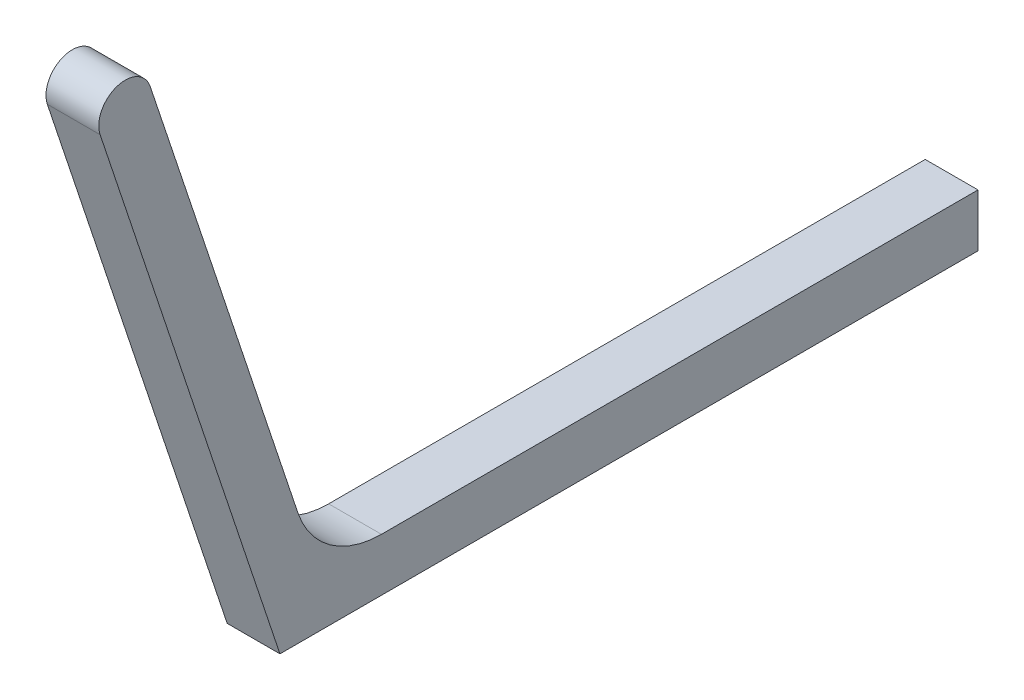
ISO-10303-21;
HEADER;
FILE_DESCRIPTION(('STEP AP214'),'2;1');
FILE_NAME('part.step','',(''),(''),'','','');
FILE_SCHEMA(('AUTOMOTIVE_DESIGN { 1 0 10303 214 1 1 1 1 }'));
ENDSEC;
DATA;
#1=APPLICATION_CONTEXT('core data for automotive mechanical design processes');
#2=APPLICATION_PROTOCOL_DEFINITION('international standard','automotive_design',2000,#1);
#3=PRODUCT_CONTEXT('',#1,'mechanical');
#4=PRODUCT('Part','Part','',(#3));
#5=PRODUCT_RELATED_PRODUCT_CATEGORY('part','',(#4));
#6=PRODUCT_DEFINITION_FORMATION('','',#4);
#7=PRODUCT_DEFINITION_CONTEXT('part definition',#1,'design');
#8=PRODUCT_DEFINITION('design','',#6,#7);
#9=PRODUCT_DEFINITION_SHAPE('','',#8);
#10=(LENGTH_UNIT() NAMED_UNIT(*) SI_UNIT(.MILLI.,.METRE.));
#11=(NAMED_UNIT(*) PLANE_ANGLE_UNIT() SI_UNIT($,.RADIAN.));
#12=(NAMED_UNIT(*) SI_UNIT($,.STERADIAN.) SOLID_ANGLE_UNIT());
#13=UNCERTAINTY_MEASURE_WITH_UNIT(LENGTH_MEASURE(1.E-05),#10,'distance_accuracy_value','');
#14=(GEOMETRIC_REPRESENTATION_CONTEXT(3) GLOBAL_UNCERTAINTY_ASSIGNED_CONTEXT((#13)) GLOBAL_UNIT_ASSIGNED_CONTEXT((#10,
#11,#12)) REPRESENTATION_CONTEXT('',''));
#15=CARTESIAN_POINT('',(0.,0.,0.));
#16=DIRECTION('',(0.,0.,1.));
#17=DIRECTION('',(1.,0.,0.));
#18=AXIS2_PLACEMENT_3D('',#15,#16,#17);
#19=CARTESIAN_POINT('',(-3.,343.662251678446,140.521550598035));
#20=DIRECTION('',(1.,0.,0.));
#21=DIRECTION('',(0.,0.,-1.));
#22=AXIS2_PLACEMENT_3D('',#19,#20,#21);
#23=CYLINDRICAL_SURFACE('',#22,2.99999999999994);
#24=CARTESIAN_POINT('',(3.,343.662251678446,140.521550598035));
#25=DIRECTION('',(1.,0.,0.));
#26=DIRECTION('',(0.,0.,-1.));
#27=AXIS2_PLACEMENT_3D('',#24,#25,#26);
#28=CIRCLE('',#27,2.99999999999994);
#29=CARTESIAN_POINT('',(3.,344.610934976496,137.675500703884));
#30=VERTEX_POINT('',#29);
#31=CARTESIAN_POINT('',(3.,342.713568380395,143.367600492187));
#32=VERTEX_POINT('',#31);
#33=EDGE_CURVE('E127',#30,#32,#28,.T.);
#34=ORIENTED_EDGE('',*,*,#33,.F.);
#35=DIRECTION('',(1.,0.,0.));
#36=VECTOR('',#35,1.);
#37=CARTESIAN_POINT('',(-3.,344.610934976496,137.675500703884));
#38=LINE('',#37,#36);
#39=CARTESIAN_POINT('',(-3.,344.610934976496,137.675500703884));
#40=VERTEX_POINT('',#39);
#41=EDGE_CURVE('E11',#40,#30,#38,.T.);
#42=ORIENTED_EDGE('',*,*,#41,.F.);
#43=CARTESIAN_POINT('',(-3.,343.662251678446,140.521550598035));
#44=DIRECTION('',(1.,0.,0.));
#45=DIRECTION('',(0.,0.,-1.));
#46=AXIS2_PLACEMENT_3D('',#43,#44,#45);
#47=CIRCLE('',#46,2.99999999999994);
#48=CARTESIAN_POINT('',(-3.,342.713568380395,143.367600492187));
#49=VERTEX_POINT('',#48);
#50=EDGE_CURVE('E144',#40,#49,#47,.T.);
#51=ORIENTED_EDGE('',*,*,#50,.T.);
#52=DIRECTION('',(1.,0.,0.));
#53=VECTOR('',#52,1.);
#54=CARTESIAN_POINT('',(-3.,342.713568380395,143.367600492187));
#55=LINE('',#54,#53);
#56=EDGE_CURVE('E39',#49,#32,#55,.T.);
#57=ORIENTED_EDGE('',*,*,#56,.T.);
#58=EDGE_LOOP('',(#34,#42,#51,#57));
#59=FACE_BOUND('',#58,.T.);
#60=ADVANCED_FACE('F36',(#59),#23,.T.);
#61=CARTESIAN_POINT('',(-3.,294.241450839048,120.885672658068));
#62=DIRECTION('',(0.,0.316227766016838,-0.948683298050514));
#63=DIRECTION('',(0.,0.948683298050514,0.316227766016839));
#64=AXIS2_PLACEMENT_3D('',#61,#62,#63);
#65=PLANE('',#64);
#66=DIRECTION('',(0.,0.948683298050514,0.316227766016839));
#67=VECTOR('',#66,1.);
#68=CARTESIAN_POINT('',(3.,294.241450839048,120.885672658068));
#69=LINE('',#68,#67);
#70=CARTESIAN_POINT('',(3.,294.241450839048,120.885672658068));
#71=VERTEX_POINT('',#70);
#72=EDGE_CURVE('E142',#71,#30,#69,.T.);
#73=ORIENTED_EDGE('',*,*,#72,.F.);
#74=DIRECTION('',(1.,0.,0.));
#75=VECTOR('',#74,1.);
#76=CARTESIAN_POINT('',(-3.,294.241450839048,120.885672658068));
#77=LINE('',#76,#75);
#78=CARTESIAN_POINT('',(-3.,294.241450839048,120.885672658068));
#79=VERTEX_POINT('',#78);
#80=EDGE_CURVE('E45',#79,#71,#77,.T.);
#81=ORIENTED_EDGE('',*,*,#80,.F.);
#82=DIRECTION('',(0.,0.948683298050514,0.316227766016839));
#83=VECTOR('',#82,1.);
#84=CARTESIAN_POINT('',(-3.,294.241450839048,120.885672658068));
#85=LINE('',#84,#83);
#86=EDGE_CURVE('E117',#79,#40,#85,.T.);
#87=ORIENTED_EDGE('',*,*,#86,.T.);
#88=ORIENTED_EDGE('',*,*,#41,.T.);
#89=EDGE_LOOP('',(#73,#81,#87,#88));
#90=FACE_BOUND('',#89,.T.);
#91=ADVANCED_FACE('F154',(#90),#65,.T.);
#92=CARTESIAN_POINT('',(-3.,297.403728499216,111.398839677562));
#93=DIRECTION('',(1.,0.,0.));
#94=DIRECTION('',(0.,0.,-1.));
#95=AXIS2_PLACEMENT_3D('',#92,#93,#94);
#96=CYLINDRICAL_SURFACE('',#95,10.0000000000003);
#97=CARTESIAN_POINT('',(3.,297.403728499216,111.398839677562));
#98=DIRECTION('',(-1.,0.,0.));
#99=DIRECTION('',(0.,0.,1.));
#100=AXIS2_PLACEMENT_3D('',#97,#98,#99);
#101=CIRCLE('',#100,10.0000000000003);
#102=CARTESIAN_POINT('',(3.,287.403728499216,111.398839677562));
#103=VERTEX_POINT('',#102);
#104=EDGE_CURVE('E104',#103,#71,#101,.T.);
#105=ORIENTED_EDGE('',*,*,#104,.F.);
#106=DIRECTION('',(1.,0.,0.));
#107=VECTOR('',#106,1.);
#108=CARTESIAN_POINT('',(-3.,287.403728499216,111.398839677562));
#109=LINE('',#108,#107);
#110=CARTESIAN_POINT('',(-3.,287.403728499216,111.398839677562));
#111=VERTEX_POINT('',#110);
#112=EDGE_CURVE('E99',#111,#103,#109,.T.);
#113=ORIENTED_EDGE('',*,*,#112,.F.);
#114=CARTESIAN_POINT('',(-3.,297.403728499216,111.398839677562));
#115=DIRECTION('',(-1.,0.,0.));
#116=DIRECTION('',(0.,0.,1.));
#117=AXIS2_PLACEMENT_3D('',#114,#115,#116);
#118=CIRCLE('',#117,10.0000000000003);
#119=EDGE_CURVE('E102',#111,#79,#118,.T.);
#120=ORIENTED_EDGE('',*,*,#119,.T.);
#121=ORIENTED_EDGE('',*,*,#80,.T.);
#122=EDGE_LOOP('',(#105,#113,#120,#121));
#123=FACE_BOUND('',#122,.T.);
#124=ADVANCED_FACE('F101',(#123),#96,.F.);
#125=CARTESIAN_POINT('',(-3.,287.403728499216,43.6064318781235));
#126=DIRECTION('',(0.,1.,0.));
#127=DIRECTION('',(0.,0.,1.));
#128=AXIS2_PLACEMENT_3D('',#125,#126,#127);
#129=PLANE('',#128);
#130=DIRECTION('',(0.,0.,1.));
#131=VECTOR('',#130,1.);
#132=CARTESIAN_POINT('',(3.,287.403728499216,43.6064318781235));
#133=LINE('',#132,#131);
#134=CARTESIAN_POINT('',(3.,287.403728499216,43.6064318781235));
#135=VERTEX_POINT('',#134);
#136=EDGE_CURVE('E139',#135,#103,#133,.T.);
#137=ORIENTED_EDGE('',*,*,#136,.F.);
#138=DIRECTION('',(1.,0.,0.));
#139=VECTOR('',#138,1.);
#140=CARTESIAN_POINT('',(-3.,287.403728499216,43.6064318781235));
#141=LINE('',#140,#139);
#142=CARTESIAN_POINT('',(-3.,287.403728499216,43.6064318781235));
#143=VERTEX_POINT('',#142);
#144=EDGE_CURVE('E109',#143,#135,#141,.T.);
#145=ORIENTED_EDGE('',*,*,#144,.F.);
#146=DIRECTION('',(0.,0.,1.));
#147=VECTOR('',#146,1.);
#148=CARTESIAN_POINT('',(-3.,287.403728499216,43.6064318781235));
#149=LINE('',#148,#147);
#150=EDGE_CURVE('E115',#143,#111,#149,.T.);
#151=ORIENTED_EDGE('',*,*,#150,.T.);
#152=ORIENTED_EDGE('',*,*,#112,.T.);
#153=EDGE_LOOP('',(#137,#145,#151,#152));
#154=FACE_BOUND('',#153,.T.);
#155=ADVANCED_FACE('F119',(#154),#129,.T.);
#156=CARTESIAN_POINT('',(-3.,281.403728499217,43.6064318781235));
#157=DIRECTION('',(0.,0.,-1.));
#158=DIRECTION('',(-1.,0.,0.));
#159=AXIS2_PLACEMENT_3D('',#156,#157,#158);
#160=PLANE('',#159);
#161=DIRECTION('',(0.,1.,0.));
#162=VECTOR('',#161,1.);
#163=CARTESIAN_POINT('',(3.,281.403728499217,43.6064318781235));
#164=LINE('',#163,#162);
#165=CARTESIAN_POINT('',(3.,281.403728499217,43.6064318781235));
#166=VERTEX_POINT('',#165);
#167=EDGE_CURVE('E136',#166,#135,#164,.T.);
#168=ORIENTED_EDGE('',*,*,#167,.F.);
#169=DIRECTION('',(1.,0.,0.));
#170=VECTOR('',#169,1.);
#171=CARTESIAN_POINT('',(-3.,281.403728499217,43.6064318781235));
#172=LINE('',#171,#170);
#173=CARTESIAN_POINT('',(-3.,281.403728499217,43.6064318781235));
#174=VERTEX_POINT('',#173);
#175=EDGE_CURVE('E148',#174,#166,#172,.T.);
#176=ORIENTED_EDGE('',*,*,#175,.F.);
#177=DIRECTION('',(0.,1.,0.));
#178=VECTOR('',#177,1.);
#179=CARTESIAN_POINT('',(-3.,281.403728499217,43.6064318781235));
#180=LINE('',#179,#178);
#181=EDGE_CURVE('E120',#174,#143,#180,.T.);
#182=ORIENTED_EDGE('',*,*,#181,.T.);
#183=ORIENTED_EDGE('',*,*,#144,.T.);
#184=EDGE_LOOP('',(#168,#176,#182,#183));
#185=FACE_BOUND('',#184,.T.);
#186=ADVANCED_FACE('F167',(#185),#160,.T.);
#187=CARTESIAN_POINT('',(-3.,281.403728499216,122.93098719846));
#188=DIRECTION('',(0.,-1.,0.));
#189=DIRECTION('',(0.,0.,-1.));
#190=AXIS2_PLACEMENT_3D('',#187,#188,#189);
#191=PLANE('',#190);
#192=DIRECTION('',(0.,0.,-1.));
#193=VECTOR('',#192,1.);
#194=CARTESIAN_POINT('',(3.,281.403728499216,122.93098719846));
#195=LINE('',#194,#193);
#196=CARTESIAN_POINT('',(3.,281.403728499216,122.93098719846));
#197=VERTEX_POINT('',#196);
#198=EDGE_CURVE('E133',#197,#166,#195,.T.);
#199=ORIENTED_EDGE('',*,*,#198,.F.);
#200=DIRECTION('',(1.,0.,0.));
#201=VECTOR('',#200,1.);
#202=CARTESIAN_POINT('',(-3.,281.403728499216,122.93098719846));
#203=LINE('',#202,#201);
#204=CARTESIAN_POINT('',(-3.,281.403728499216,122.93098719846));
#205=VERTEX_POINT('',#204);
#206=EDGE_CURVE('E149',#205,#197,#203,.T.);
#207=ORIENTED_EDGE('',*,*,#206,.F.);
#208=DIRECTION('',(0.,0.,-1.));
#209=VECTOR('',#208,1.);
#210=CARTESIAN_POINT('',(-3.,281.403728499216,122.93098719846));
#211=LINE('',#210,#209);
#212=EDGE_CURVE('E122',#205,#174,#211,.T.);
#213=ORIENTED_EDGE('',*,*,#212,.T.);
#214=ORIENTED_EDGE('',*,*,#175,.T.);
#215=EDGE_LOOP('',(#199,#207,#213,#214));
#216=FACE_BOUND('',#215,.T.);
#217=ADVANCED_FACE('F170',(#216),#191,.T.);
#218=CARTESIAN_POINT('',(-3.,342.713568380395,143.367600492187));
#219=DIRECTION('',(0.,-0.316227766016847,0.948683298050511));
#220=DIRECTION('',(0.,-0.948683298050511,-0.316227766016847));
#221=AXIS2_PLACEMENT_3D('',#218,#219,#220);
#222=PLANE('',#221);
#223=DIRECTION('',(0.,-0.948683298050511,-0.316227766016847));
#224=VECTOR('',#223,1.);
#225=CARTESIAN_POINT('',(3.,342.713568380395,143.367600492187));
#226=LINE('',#225,#224);
#227=EDGE_CURVE('E130',#32,#197,#226,.T.);
#228=ORIENTED_EDGE('',*,*,#227,.F.);
#229=ORIENTED_EDGE('',*,*,#56,.F.);
#230=DIRECTION('',(0.,-0.948683298050511,-0.316227766016847));
#231=VECTOR('',#230,1.);
#232=CARTESIAN_POINT('',(-3.,342.713568380395,143.367600492187));
#233=LINE('',#232,#231);
#234=EDGE_CURVE('E232',#49,#205,#233,.T.);
#235=ORIENTED_EDGE('',*,*,#234,.T.);
#236=ORIENTED_EDGE('',*,*,#206,.T.);
#237=EDGE_LOOP('',(#228,#229,#235,#236));
#238=FACE_BOUND('',#237,.T.);
#239=ADVANCED_FACE('F151',(#238),#222,.T.);
#240=CARTESIAN_POINT('',(-3.,343.662251678446,140.521550598035));
#241=DIRECTION('',(1.,0.,0.));
#242=DIRECTION('',(0.,0.,-1.));
#243=AXIS2_PLACEMENT_3D('',#240,#241,#242);
#244=PLANE('',#243);
#245=ORIENTED_EDGE('',*,*,#50,.F.);
#246=ORIENTED_EDGE('',*,*,#86,.F.);
#247=ORIENTED_EDGE('',*,*,#119,.F.);
#248=ORIENTED_EDGE('',*,*,#150,.F.);
#249=ORIENTED_EDGE('',*,*,#181,.F.);
#250=ORIENTED_EDGE('',*,*,#212,.F.);
#251=ORIENTED_EDGE('',*,*,#234,.F.);
#252=EDGE_LOOP('',(#245,#246,#247,#248,#249,#250,#251));
#253=FACE_BOUND('',#252,.T.);
#254=ADVANCED_FACE('F113',(#253),#244,.F.);
#255=CARTESIAN_POINT('',(3.,343.662251678446,140.521550598035));
#256=DIRECTION('',(1.,0.,0.));
#257=DIRECTION('',(0.,0.,-1.));
#258=AXIS2_PLACEMENT_3D('',#255,#256,#257);
#259=PLANE('',#258);
#260=ORIENTED_EDGE('',*,*,#33,.T.);
#261=ORIENTED_EDGE('',*,*,#227,.T.);
#262=ORIENTED_EDGE('',*,*,#198,.T.);
#263=ORIENTED_EDGE('',*,*,#167,.T.);
#264=ORIENTED_EDGE('',*,*,#136,.T.);
#265=ORIENTED_EDGE('',*,*,#104,.T.);
#266=ORIENTED_EDGE('',*,*,#72,.T.);
#267=EDGE_LOOP('',(#260,#261,#262,#263,#264,#265,#266));
#268=FACE_BOUND('',#267,.T.);
#269=ADVANCED_FACE('F153',(#268),#259,.T.);
#270=CLOSED_SHELL('',(#60,#91,#124,#155,#186,#217,#239,#254,#269));
#271=MANIFOLD_SOLID_BREP('B2',#270);
#272=ADVANCED_BREP_SHAPE_REPRESENTATION('',(#18,#271),#14);
#273=SHAPE_DEFINITION_REPRESENTATION(#9,#272);
ENDSEC;
END-ISO-10303-21;
